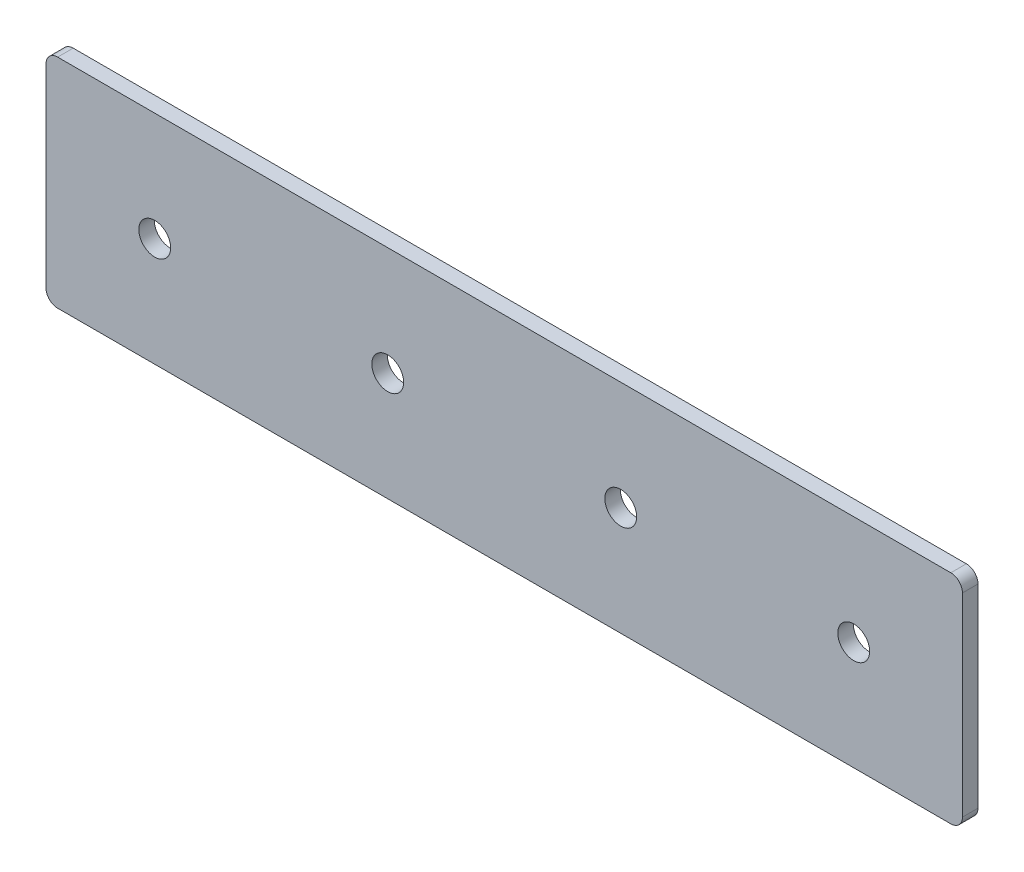
ISO-10303-21;
HEADER;
FILE_DESCRIPTION(('STEP AP214'),'2;1');
FILE_NAME('part.step','',(''),(''),'','','');
FILE_SCHEMA(('AUTOMOTIVE_DESIGN { 1 0 10303 214 1 1 1 1 }'));
ENDSEC;
DATA;
#1=APPLICATION_CONTEXT('core data for automotive mechanical design processes');
#2=APPLICATION_PROTOCOL_DEFINITION('international standard','automotive_design',2000,#1);
#3=PRODUCT_CONTEXT('',#1,'mechanical');
#4=PRODUCT('Part','Part','',(#3));
#5=PRODUCT_RELATED_PRODUCT_CATEGORY('part','',(#4));
#6=PRODUCT_DEFINITION_FORMATION('','',#4);
#7=PRODUCT_DEFINITION_CONTEXT('part definition',#1,'design');
#8=PRODUCT_DEFINITION('design','',#6,#7);
#9=PRODUCT_DEFINITION_SHAPE('','',#8);
#10=(LENGTH_UNIT() NAMED_UNIT(*) SI_UNIT(.MILLI.,.METRE.));
#11=(NAMED_UNIT(*) PLANE_ANGLE_UNIT() SI_UNIT($,.RADIAN.));
#12=(NAMED_UNIT(*) SI_UNIT($,.STERADIAN.) SOLID_ANGLE_UNIT());
#13=UNCERTAINTY_MEASURE_WITH_UNIT(LENGTH_MEASURE(1.E-05),#10,'distance_accuracy_value','');
#14=(GEOMETRIC_REPRESENTATION_CONTEXT(3) GLOBAL_UNCERTAINTY_ASSIGNED_CONTEXT((#13)) GLOBAL_UNIT_ASSIGNED_CONTEXT((#10,
#11,#12)) REPRESENTATION_CONTEXT('',''));
#15=CARTESIAN_POINT('',(0.,0.,0.));
#16=DIRECTION('',(0.,0.,1.));
#17=DIRECTION('',(1.,0.,0.));
#18=AXIS2_PLACEMENT_3D('',#15,#16,#17);
#19=CARTESIAN_POINT('',(0.,0.,4.));
#20=DIRECTION('',(0.,0.,1.));
#21=DIRECTION('',(1.,0.,0.));
#22=AXIS2_PLACEMENT_3D('',#19,#20,#21);
#23=PLANE('',#22);
#24=CARTESIAN_POINT('',(120.,0.,4.));
#25=DIRECTION('',(0.,0.,1.));
#26=DIRECTION('',(1.,0.,0.));
#27=AXIS2_PLACEMENT_3D('',#24,#25,#26);
#28=CIRCLE('',#27,4.1);
#29=CARTESIAN_POINT('',(124.1,0.,4.));
#30=VERTEX_POINT('',#29);
#31=EDGE_CURVE('E168',#30,#30,#28,.T.);
#32=ORIENTED_EDGE('',*,*,#31,.F.);
#33=EDGE_LOOP('',(#32));
#34=FACE_BOUND('',#33,.T.);
#35=CARTESIAN_POINT('',(0.,0.,4.));
#36=DIRECTION('',(0.,0.,1.));
#37=DIRECTION('',(1.,0.,0.));
#38=AXIS2_PLACEMENT_3D('',#35,#36,#37);
#39=CIRCLE('',#38,4.1);
#40=CARTESIAN_POINT('',(4.1,0.,4.));
#41=VERTEX_POINT('',#40);
#42=EDGE_CURVE('E114',#41,#41,#39,.T.);
#43=ORIENTED_EDGE('',*,*,#42,.F.);
#44=EDGE_LOOP('',(#43));
#45=FACE_BOUND('',#44,.T.);
#46=DIRECTION('',(0.,-1.,0.));
#47=VECTOR('',#46,1.);
#48=CARTESIAN_POINT('',(-28.,28.,4.));
#49=LINE('',#48,#47);
#50=CARTESIAN_POINT('',(-28.,25.,4.));
#51=VERTEX_POINT('',#50);
#52=CARTESIAN_POINT('',(-28.,-25.,4.));
#53=VERTEX_POINT('',#52);
#54=EDGE_CURVE('E119',#51,#53,#49,.T.);
#55=ORIENTED_EDGE('',*,*,#54,.T.);
#56=CARTESIAN_POINT('',(-25.,-25.,4.));
#57=DIRECTION('',(0.,0.,1.));
#58=DIRECTION('',(1.,0.,0.));
#59=AXIS2_PLACEMENT_3D('',#56,#57,#58);
#60=CIRCLE('',#59,3.);
#61=CARTESIAN_POINT('',(-25.,-28.,4.));
#62=VERTEX_POINT('',#61);
#63=EDGE_CURVE('E134',#53,#62,#60,.T.);
#64=ORIENTED_EDGE('',*,*,#63,.T.);
#65=DIRECTION('',(1.,0.,0.));
#66=VECTOR('',#65,1.);
#67=CARTESIAN_POINT('',(-28.,-28.,4.));
#68=LINE('',#67,#66);
#69=CARTESIAN_POINT('',(205.,-28.,4.));
#70=VERTEX_POINT('',#69);
#71=EDGE_CURVE('E101',#62,#70,#68,.T.);
#72=ORIENTED_EDGE('',*,*,#71,.T.);
#73=CARTESIAN_POINT('',(205.,-25.,4.));
#74=DIRECTION('',(0.,0.,1.));
#75=DIRECTION('',(1.,0.,0.));
#76=AXIS2_PLACEMENT_3D('',#73,#74,#75);
#77=CIRCLE('',#76,3.);
#78=CARTESIAN_POINT('',(208.,-25.,4.));
#79=VERTEX_POINT('',#78);
#80=EDGE_CURVE('E132',#70,#79,#77,.T.);
#81=ORIENTED_EDGE('',*,*,#80,.T.);
#82=DIRECTION('',(0.,1.,0.));
#83=VECTOR('',#82,1.);
#84=CARTESIAN_POINT('',(208.,28.,4.));
#85=LINE('',#84,#83);
#86=CARTESIAN_POINT('',(208.,25.,4.));
#87=VERTEX_POINT('',#86);
#88=EDGE_CURVE('E145',#79,#87,#85,.T.);
#89=ORIENTED_EDGE('',*,*,#88,.T.);
#90=CARTESIAN_POINT('',(205.,25.,4.));
#91=DIRECTION('',(0.,0.,1.));
#92=DIRECTION('',(1.,0.,0.));
#93=AXIS2_PLACEMENT_3D('',#90,#91,#92);
#94=CIRCLE('',#93,3.);
#95=CARTESIAN_POINT('',(205.,28.,4.));
#96=VERTEX_POINT('',#95);
#97=EDGE_CURVE('E36',#87,#96,#94,.T.);
#98=ORIENTED_EDGE('',*,*,#97,.T.);
#99=DIRECTION('',(-1.,0.,0.));
#100=VECTOR('',#99,1.);
#101=CARTESIAN_POINT('',(-28.,28.,4.));
#102=LINE('',#101,#100);
#103=CARTESIAN_POINT('',(-25.,28.,4.));
#104=VERTEX_POINT('',#103);
#105=EDGE_CURVE('E120',#96,#104,#102,.T.);
#106=ORIENTED_EDGE('',*,*,#105,.T.);
#107=CARTESIAN_POINT('',(-25.,25.,4.));
#108=DIRECTION('',(0.,0.,1.));
#109=DIRECTION('',(1.,0.,0.));
#110=AXIS2_PLACEMENT_3D('',#107,#108,#109);
#111=CIRCLE('',#110,3.);
#112=EDGE_CURVE('E129',#104,#51,#111,.T.);
#113=ORIENTED_EDGE('',*,*,#112,.T.);
#114=EDGE_LOOP('',(#55,#64,#72,#81,#89,#98,#106,#113));
#115=FACE_BOUND('',#114,.T.);
#116=CARTESIAN_POINT('',(60.,0.,4.));
#117=DIRECTION('',(0.,0.,1.));
#118=DIRECTION('',(1.,0.,0.));
#119=AXIS2_PLACEMENT_3D('',#116,#117,#118);
#120=CIRCLE('',#119,4.09999999999999);
#121=CARTESIAN_POINT('',(64.1,0.,4.));
#122=VERTEX_POINT('',#121);
#123=EDGE_CURVE('E162',#122,#122,#120,.T.);
#124=ORIENTED_EDGE('',*,*,#123,.F.);
#125=EDGE_LOOP('',(#124));
#126=FACE_BOUND('',#125,.T.);
#127=CARTESIAN_POINT('',(180.,0.,4.));
#128=DIRECTION('',(0.,0.,1.));
#129=DIRECTION('',(1.,0.,0.));
#130=AXIS2_PLACEMENT_3D('',#127,#128,#129);
#131=CIRCLE('',#130,4.09999999999999);
#132=CARTESIAN_POINT('',(184.1,0.,4.));
#133=VERTEX_POINT('',#132);
#134=EDGE_CURVE('E174',#133,#133,#131,.T.);
#135=ORIENTED_EDGE('',*,*,#134,.F.);
#136=EDGE_LOOP('',(#135));
#137=FACE_BOUND('',#136,.T.);
#138=ADVANCED_FACE('F15',(#34,#45,#115,#126,#137),#23,.T.);
#139=CARTESIAN_POINT('',(0.,0.,0.));
#140=DIRECTION('',(0.,0.,1.));
#141=DIRECTION('',(1.,0.,0.));
#142=AXIS2_PLACEMENT_3D('',#139,#140,#141);
#143=PLANE('',#142);
#144=DIRECTION('',(1.,0.,0.));
#145=VECTOR('',#144,1.);
#146=CARTESIAN_POINT('',(-28.,-28.,0.));
#147=LINE('',#146,#145);
#148=CARTESIAN_POINT('',(-25.,-28.,0.));
#149=VERTEX_POINT('',#148);
#150=CARTESIAN_POINT('',(205.,-28.,0.));
#151=VERTEX_POINT('',#150);
#152=EDGE_CURVE('E98',#149,#151,#147,.T.);
#153=ORIENTED_EDGE('',*,*,#152,.F.);
#154=CARTESIAN_POINT('',(-25.,-25.,0.));
#155=DIRECTION('',(0.,0.,1.));
#156=DIRECTION('',(1.,0.,0.));
#157=AXIS2_PLACEMENT_3D('',#154,#155,#156);
#158=CIRCLE('',#157,3.);
#159=CARTESIAN_POINT('',(-28.,-25.,0.));
#160=VERTEX_POINT('',#159);
#161=EDGE_CURVE('E81',#149,#160,#158,.F.);
#162=ORIENTED_EDGE('',*,*,#161,.T.);
#163=DIRECTION('',(0.,-1.,0.));
#164=VECTOR('',#163,1.);
#165=CARTESIAN_POINT('',(-28.,28.,0.));
#166=LINE('',#165,#164);
#167=CARTESIAN_POINT('',(-28.,25.,0.));
#168=VERTEX_POINT('',#167);
#169=EDGE_CURVE('E109',#168,#160,#166,.T.);
#170=ORIENTED_EDGE('',*,*,#169,.F.);
#171=CARTESIAN_POINT('',(-25.,25.,0.));
#172=DIRECTION('',(0.,0.,1.));
#173=DIRECTION('',(1.,0.,0.));
#174=AXIS2_PLACEMENT_3D('',#171,#172,#173);
#175=CIRCLE('',#174,3.);
#176=CARTESIAN_POINT('',(-25.,28.,0.));
#177=VERTEX_POINT('',#176);
#178=EDGE_CURVE('E102',#168,#177,#175,.F.);
#179=ORIENTED_EDGE('',*,*,#178,.T.);
#180=DIRECTION('',(-1.,0.,0.));
#181=VECTOR('',#180,1.);
#182=CARTESIAN_POINT('',(-28.,28.,0.));
#183=LINE('',#182,#181);
#184=CARTESIAN_POINT('',(205.,28.,0.));
#185=VERTEX_POINT('',#184);
#186=EDGE_CURVE('E112',#185,#177,#183,.T.);
#187=ORIENTED_EDGE('',*,*,#186,.F.);
#188=CARTESIAN_POINT('',(205.,25.,0.));
#189=DIRECTION('',(0.,0.,1.));
#190=DIRECTION('',(1.,0.,0.));
#191=AXIS2_PLACEMENT_3D('',#188,#189,#190);
#192=CIRCLE('',#191,3.);
#193=CARTESIAN_POINT('',(208.,25.,0.));
#194=VERTEX_POINT('',#193);
#195=EDGE_CURVE('E123',#185,#194,#192,.F.);
#196=ORIENTED_EDGE('',*,*,#195,.T.);
#197=DIRECTION('',(0.,1.,0.));
#198=VECTOR('',#197,1.);
#199=CARTESIAN_POINT('',(208.,28.,0.));
#200=LINE('',#199,#198);
#201=CARTESIAN_POINT('',(208.,-25.,0.));
#202=VERTEX_POINT('',#201);
#203=EDGE_CURVE('E108',#202,#194,#200,.T.);
#204=ORIENTED_EDGE('',*,*,#203,.F.);
#205=CARTESIAN_POINT('',(205.,-25.,0.));
#206=DIRECTION('',(0.,0.,1.));
#207=DIRECTION('',(1.,0.,0.));
#208=AXIS2_PLACEMENT_3D('',#205,#206,#207);
#209=CIRCLE('',#208,3.);
#210=EDGE_CURVE('E92',#202,#151,#209,.F.);
#211=ORIENTED_EDGE('',*,*,#210,.T.);
#212=EDGE_LOOP('',(#153,#162,#170,#179,#187,#196,#204,#211));
#213=FACE_BOUND('',#212,.T.);
#214=CARTESIAN_POINT('',(0.,0.,0.));
#215=DIRECTION('',(0.,0.,1.));
#216=DIRECTION('',(1.,0.,0.));
#217=AXIS2_PLACEMENT_3D('',#214,#215,#216);
#218=CIRCLE('',#217,4.1);
#219=CARTESIAN_POINT('',(4.1,0.,0.));
#220=VERTEX_POINT('',#219);
#221=EDGE_CURVE('E159',#220,#220,#218,.T.);
#222=ORIENTED_EDGE('',*,*,#221,.T.);
#223=EDGE_LOOP('',(#222));
#224=FACE_BOUND('',#223,.T.);
#225=CARTESIAN_POINT('',(60.,0.,0.));
#226=DIRECTION('',(0.,0.,1.));
#227=DIRECTION('',(1.,0.,0.));
#228=AXIS2_PLACEMENT_3D('',#225,#226,#227);
#229=CIRCLE('',#228,4.09999999999999);
#230=CARTESIAN_POINT('',(64.1,0.,0.));
#231=VERTEX_POINT('',#230);
#232=EDGE_CURVE('E165',#231,#231,#229,.T.);
#233=ORIENTED_EDGE('',*,*,#232,.T.);
#234=EDGE_LOOP('',(#233));
#235=FACE_BOUND('',#234,.T.);
#236=CARTESIAN_POINT('',(120.,0.,0.));
#237=DIRECTION('',(0.,0.,1.));
#238=DIRECTION('',(1.,0.,0.));
#239=AXIS2_PLACEMENT_3D('',#236,#237,#238);
#240=CIRCLE('',#239,4.1);
#241=CARTESIAN_POINT('',(124.1,0.,0.));
#242=VERTEX_POINT('',#241);
#243=EDGE_CURVE('E171',#242,#242,#240,.T.);
#244=ORIENTED_EDGE('',*,*,#243,.T.);
#245=EDGE_LOOP('',(#244));
#246=FACE_BOUND('',#245,.T.);
#247=CARTESIAN_POINT('',(180.,0.,0.));
#248=DIRECTION('',(0.,0.,1.));
#249=DIRECTION('',(1.,0.,0.));
#250=AXIS2_PLACEMENT_3D('',#247,#248,#249);
#251=CIRCLE('',#250,4.09999999999999);
#252=CARTESIAN_POINT('',(184.1,0.,0.));
#253=VERTEX_POINT('',#252);
#254=EDGE_CURVE('E177',#253,#253,#251,.T.);
#255=ORIENTED_EDGE('',*,*,#254,.T.);
#256=EDGE_LOOP('',(#255));
#257=FACE_BOUND('',#256,.T.);
#258=ADVANCED_FACE('F105',(#213,#224,#235,#246,#257),#143,.F.);
#259=CARTESIAN_POINT('',(-28.,28.,4.));
#260=DIRECTION('',(1.,0.,0.));
#261=DIRECTION('',(0.,1.,0.));
#262=AXIS2_PLACEMENT_3D('',#259,#260,#261);
#263=PLANE('',#262);
#264=ORIENTED_EDGE('',*,*,#169,.T.);
#265=DIRECTION('',(0.,0.,-1.));
#266=VECTOR('',#265,1.);
#267=CARTESIAN_POINT('',(-28.,-25.,4.));
#268=LINE('',#267,#266);
#269=EDGE_CURVE('E86',#160,#53,#268,.F.);
#270=ORIENTED_EDGE('',*,*,#269,.T.);
#271=ORIENTED_EDGE('',*,*,#54,.F.);
#272=DIRECTION('',(0.,0.,-1.));
#273=VECTOR('',#272,1.);
#274=CARTESIAN_POINT('',(-28.,25.,4.));
#275=LINE('',#274,#273);
#276=EDGE_CURVE('E91',#51,#168,#275,.T.);
#277=ORIENTED_EDGE('',*,*,#276,.T.);
#278=EDGE_LOOP('',(#264,#270,#271,#277));
#279=FACE_BOUND('',#278,.T.);
#280=ADVANCED_FACE('F193',(#279),#263,.F.);
#281=CARTESIAN_POINT('',(-28.,-28.,4.));
#282=DIRECTION('',(0.,1.,0.));
#283=DIRECTION('',(-1.,0.,0.));
#284=AXIS2_PLACEMENT_3D('',#281,#282,#283);
#285=PLANE('',#284);
#286=ORIENTED_EDGE('',*,*,#71,.F.);
#287=DIRECTION('',(0.,0.,-1.));
#288=VECTOR('',#287,1.);
#289=CARTESIAN_POINT('',(-25.,-28.,4.));
#290=LINE('',#289,#288);
#291=EDGE_CURVE('E85',#62,#149,#290,.T.);
#292=ORIENTED_EDGE('',*,*,#291,.T.);
#293=ORIENTED_EDGE('',*,*,#152,.T.);
#294=DIRECTION('',(0.,0.,-1.));
#295=VECTOR('',#294,1.);
#296=CARTESIAN_POINT('',(205.,-28.,4.));
#297=LINE('',#296,#295);
#298=EDGE_CURVE('E103',#151,#70,#297,.F.);
#299=ORIENTED_EDGE('',*,*,#298,.T.);
#300=EDGE_LOOP('',(#286,#292,#293,#299));
#301=FACE_BOUND('',#300,.T.);
#302=ADVANCED_FACE('F97',(#301),#285,.F.);
#303=CARTESIAN_POINT('',(208.,28.,4.));
#304=DIRECTION('',(-1.,0.,0.));
#305=DIRECTION('',(0.,0.,1.));
#306=AXIS2_PLACEMENT_3D('',#303,#304,#305);
#307=PLANE('',#306);
#308=ORIENTED_EDGE('',*,*,#88,.F.);
#309=DIRECTION('',(0.,0.,-1.));
#310=VECTOR('',#309,1.);
#311=CARTESIAN_POINT('',(208.,-25.,4.));
#312=LINE('',#311,#310);
#313=EDGE_CURVE('E138',#79,#202,#312,.T.);
#314=ORIENTED_EDGE('',*,*,#313,.T.);
#315=ORIENTED_EDGE('',*,*,#203,.T.);
#316=DIRECTION('',(0.,0.,-1.));
#317=VECTOR('',#316,1.);
#318=CARTESIAN_POINT('',(208.,25.,4.));
#319=LINE('',#318,#317);
#320=EDGE_CURVE('E136',#194,#87,#319,.F.);
#321=ORIENTED_EDGE('',*,*,#320,.T.);
#322=EDGE_LOOP('',(#308,#314,#315,#321));
#323=FACE_BOUND('',#322,.T.);
#324=ADVANCED_FACE('F143',(#323),#307,.F.);
#325=CARTESIAN_POINT('',(-28.,28.,4.));
#326=DIRECTION('',(0.,-1.,0.));
#327=DIRECTION('',(1.,0.,0.));
#328=AXIS2_PLACEMENT_3D('',#325,#326,#327);
#329=PLANE('',#328);
#330=ORIENTED_EDGE('',*,*,#105,.F.);
#331=DIRECTION('',(0.,0.,-1.));
#332=VECTOR('',#331,1.);
#333=CARTESIAN_POINT('',(205.,28.,4.));
#334=LINE('',#333,#332);
#335=EDGE_CURVE('E9',#96,#185,#334,.T.);
#336=ORIENTED_EDGE('',*,*,#335,.T.);
#337=ORIENTED_EDGE('',*,*,#186,.T.);
#338=DIRECTION('',(0.,0.,-1.));
#339=VECTOR('',#338,1.);
#340=CARTESIAN_POINT('',(-25.,28.,4.));
#341=LINE('',#340,#339);
#342=EDGE_CURVE('E23',#177,#104,#341,.F.);
#343=ORIENTED_EDGE('',*,*,#342,.T.);
#344=EDGE_LOOP('',(#330,#336,#337,#343));
#345=FACE_BOUND('',#344,.T.);
#346=ADVANCED_FACE('F152',(#345),#329,.F.);
#347=CARTESIAN_POINT('',(0.,0.,4.));
#348=DIRECTION('',(0.,0.,-1.));
#349=DIRECTION('',(-1.,0.,0.));
#350=AXIS2_PLACEMENT_3D('',#347,#348,#349);
#351=CYLINDRICAL_SURFACE('',#350,4.1);
#352=ORIENTED_EDGE('',*,*,#42,.T.);
#353=EDGE_LOOP('',(#352));
#354=FACE_BOUND('',#353,.T.);
#355=ORIENTED_EDGE('',*,*,#221,.F.);
#356=EDGE_LOOP('',(#355));
#357=FACE_BOUND('',#356,.T.);
#358=ADVANCED_FACE('F198',(#354,#357),#351,.F.);
#359=CARTESIAN_POINT('',(60.,0.,4.));
#360=DIRECTION('',(0.,0.,-1.));
#361=DIRECTION('',(-1.,0.,0.));
#362=AXIS2_PLACEMENT_3D('',#359,#360,#361);
#363=CYLINDRICAL_SURFACE('',#362,4.09999999999999);
#364=ORIENTED_EDGE('',*,*,#123,.T.);
#365=EDGE_LOOP('',(#364));
#366=FACE_BOUND('',#365,.T.);
#367=ORIENTED_EDGE('',*,*,#232,.F.);
#368=EDGE_LOOP('',(#367));
#369=FACE_BOUND('',#368,.T.);
#370=ADVANCED_FACE('F226',(#366,#369),#363,.F.);
#371=CARTESIAN_POINT('',(120.,0.,4.));
#372=DIRECTION('',(0.,0.,-1.));
#373=DIRECTION('',(-1.,0.,0.));
#374=AXIS2_PLACEMENT_3D('',#371,#372,#373);
#375=CYLINDRICAL_SURFACE('',#374,4.1);
#376=ORIENTED_EDGE('',*,*,#31,.T.);
#377=EDGE_LOOP('',(#376));
#378=FACE_BOUND('',#377,.T.);
#379=ORIENTED_EDGE('',*,*,#243,.F.);
#380=EDGE_LOOP('',(#379));
#381=FACE_BOUND('',#380,.T.);
#382=ADVANCED_FACE('F229',(#378,#381),#375,.F.);
#383=CARTESIAN_POINT('',(180.,0.,4.));
#384=DIRECTION('',(0.,0.,-1.));
#385=DIRECTION('',(-1.,0.,0.));
#386=AXIS2_PLACEMENT_3D('',#383,#384,#385);
#387=CYLINDRICAL_SURFACE('',#386,4.09999999999999);
#388=ORIENTED_EDGE('',*,*,#134,.T.);
#389=EDGE_LOOP('',(#388));
#390=FACE_BOUND('',#389,.T.);
#391=ORIENTED_EDGE('',*,*,#254,.F.);
#392=EDGE_LOOP('',(#391));
#393=FACE_BOUND('',#392,.T.);
#394=ADVANCED_FACE('F183',(#390,#393),#387,.F.);
#395=CARTESIAN_POINT('',(-25.,-25.,4.));
#396=DIRECTION('',(0.,0.,-1.));
#397=DIRECTION('',(-1.,0.,0.));
#398=AXIS2_PLACEMENT_3D('',#395,#396,#397);
#399=CYLINDRICAL_SURFACE('',#398,3.);
#400=ORIENTED_EDGE('',*,*,#63,.F.);
#401=ORIENTED_EDGE('',*,*,#269,.F.);
#402=ORIENTED_EDGE('',*,*,#161,.F.);
#403=ORIENTED_EDGE('',*,*,#291,.F.);
#404=EDGE_LOOP('',(#400,#401,#402,#403));
#405=FACE_BOUND('',#404,.T.);
#406=ADVANCED_FACE('F84',(#405),#399,.T.);
#407=CARTESIAN_POINT('',(205.,-25.,4.));
#408=DIRECTION('',(0.,0.,-1.));
#409=DIRECTION('',(-1.,0.,0.));
#410=AXIS2_PLACEMENT_3D('',#407,#408,#409);
#411=CYLINDRICAL_SURFACE('',#410,3.);
#412=ORIENTED_EDGE('',*,*,#80,.F.);
#413=ORIENTED_EDGE('',*,*,#298,.F.);
#414=ORIENTED_EDGE('',*,*,#210,.F.);
#415=ORIENTED_EDGE('',*,*,#313,.F.);
#416=EDGE_LOOP('',(#412,#413,#414,#415));
#417=FACE_BOUND('',#416,.T.);
#418=ADVANCED_FACE('F212',(#417),#411,.T.);
#419=CARTESIAN_POINT('',(205.,25.,4.));
#420=DIRECTION('',(0.,0.,-1.));
#421=DIRECTION('',(-1.,0.,0.));
#422=AXIS2_PLACEMENT_3D('',#419,#420,#421);
#423=CYLINDRICAL_SURFACE('',#422,3.);
#424=ORIENTED_EDGE('',*,*,#97,.F.);
#425=ORIENTED_EDGE('',*,*,#320,.F.);
#426=ORIENTED_EDGE('',*,*,#195,.F.);
#427=ORIENTED_EDGE('',*,*,#335,.F.);
#428=EDGE_LOOP('',(#424,#425,#426,#427));
#429=FACE_BOUND('',#428,.T.);
#430=ADVANCED_FACE('F151',(#429),#423,.T.);
#431=CARTESIAN_POINT('',(-25.,25.,4.));
#432=DIRECTION('',(0.,0.,-1.));
#433=DIRECTION('',(-1.,0.,0.));
#434=AXIS2_PLACEMENT_3D('',#431,#432,#433);
#435=CYLINDRICAL_SURFACE('',#434,3.);
#436=ORIENTED_EDGE('',*,*,#112,.F.);
#437=ORIENTED_EDGE('',*,*,#342,.F.);
#438=ORIENTED_EDGE('',*,*,#178,.F.);
#439=ORIENTED_EDGE('',*,*,#276,.F.);
#440=EDGE_LOOP('',(#436,#437,#438,#439));
#441=FACE_BOUND('',#440,.T.);
#442=ADVANCED_FACE('F17',(#441),#435,.T.);
#443=CLOSED_SHELL('',(#138,#258,#280,#302,#324,#346,#358,#370,#382,#394,#406,#418,#430,#442));
#444=MANIFOLD_SOLID_BREP('B1',#443);
#445=ADVANCED_BREP_SHAPE_REPRESENTATION('',(#18,#444),#14);
#446=SHAPE_DEFINITION_REPRESENTATION(#9,#445);
ENDSEC;
END-ISO-10303-21;
